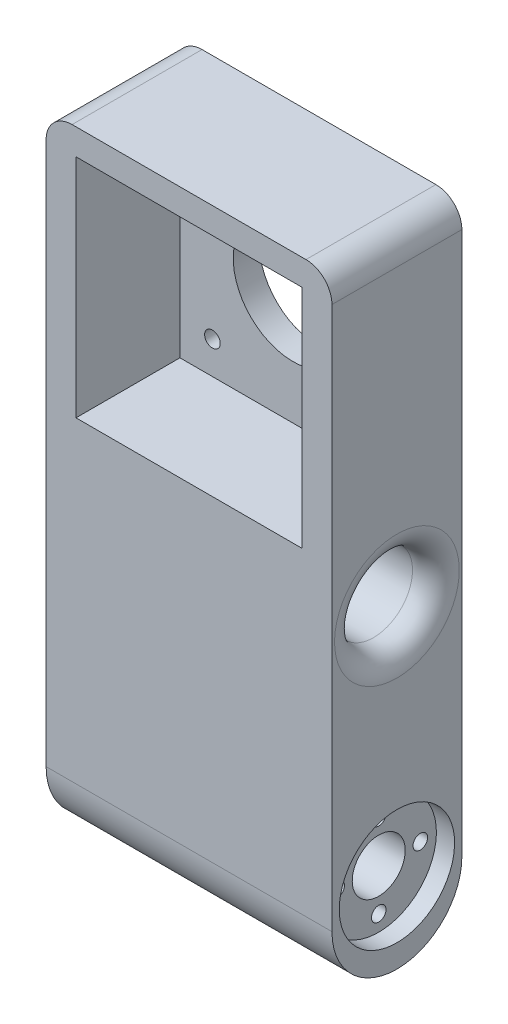
ISO-10303-21;
HEADER;
FILE_DESCRIPTION(('STEP AP214'),'2;1');
FILE_NAME('part.step','',(''),(''),'','','');
FILE_SCHEMA(('AUTOMOTIVE_DESIGN { 1 0 10303 214 1 1 1 1 }'));
ENDSEC;
DATA;
#1=APPLICATION_CONTEXT('core data for automotive mechanical design processes');
#2=APPLICATION_PROTOCOL_DEFINITION('international standard','automotive_design',2000,#1);
#3=PRODUCT_CONTEXT('',#1,'mechanical');
#4=PRODUCT('Part','Part','',(#3));
#5=PRODUCT_RELATED_PRODUCT_CATEGORY('part','',(#4));
#6=PRODUCT_DEFINITION_FORMATION('','',#4);
#7=PRODUCT_DEFINITION_CONTEXT('part definition',#1,'design');
#8=PRODUCT_DEFINITION('design','',#6,#7);
#9=PRODUCT_DEFINITION_SHAPE('','',#8);
#10=(LENGTH_UNIT() NAMED_UNIT(*) SI_UNIT(.MILLI.,.METRE.));
#11=(NAMED_UNIT(*) PLANE_ANGLE_UNIT() SI_UNIT($,.RADIAN.));
#12=(NAMED_UNIT(*) SI_UNIT($,.STERADIAN.) SOLID_ANGLE_UNIT());
#13=UNCERTAINTY_MEASURE_WITH_UNIT(LENGTH_MEASURE(1.E-05),#10,'distance_accuracy_value','');
#14=(GEOMETRIC_REPRESENTATION_CONTEXT(3) GLOBAL_UNCERTAINTY_ASSIGNED_CONTEXT((#13)) GLOBAL_UNIT_ASSIGNED_CONTEXT((#10,
#11,#12)) REPRESENTATION_CONTEXT('',''));
#15=CARTESIAN_POINT('',(0.,0.,0.));
#16=DIRECTION('',(0.,0.,1.));
#17=DIRECTION('',(1.,0.,0.));
#18=AXIS2_PLACEMENT_3D('',#15,#16,#17);
#19=CARTESIAN_POINT('',(-15.5,49.75,25.));
#20=DIRECTION('',(0.,0.,-1.));
#21=DIRECTION('',(-1.,0.,0.));
#22=AXIS2_PLACEMENT_3D('',#19,#20,#21);
#23=CYLINDRICAL_SURFACE('',#22,1.5);
#24=CARTESIAN_POINT('',(-15.5,49.75,5.));
#25=DIRECTION('',(0.,0.,1.));
#26=DIRECTION('',(1.,0.,0.));
#27=AXIS2_PLACEMENT_3D('',#24,#25,#26);
#28=CIRCLE('',#27,1.5);
#29=CARTESIAN_POINT('',(-14.,49.75,5.));
#30=VERTEX_POINT('',#29);
#31=EDGE_CURVE('E164',#30,#30,#28,.T.);
#32=ORIENTED_EDGE('',*,*,#31,.T.);
#33=EDGE_LOOP('',(#32));
#34=FACE_BOUND('',#33,.T.);
#35=CARTESIAN_POINT('',(-15.5,49.75,2.));
#36=DIRECTION('',(0.,0.,-1.));
#37=DIRECTION('',(-1.,0.,0.));
#38=AXIS2_PLACEMENT_3D('',#35,#36,#37);
#39=CIRCLE('',#38,1.5);
#40=CARTESIAN_POINT('',(-17.,49.75,2.));
#41=VERTEX_POINT('',#40);
#42=EDGE_CURVE('E40',#41,#41,#39,.T.);
#43=ORIENTED_EDGE('',*,*,#42,.T.);
#44=EDGE_LOOP('',(#43));
#45=FACE_BOUND('',#44,.T.);
#46=ADVANCED_FACE('F35',(#34,#45),#23,.F.);
#47=CARTESIAN_POINT('',(15.5,49.75,25.));
#48=DIRECTION('',(0.,0.,-1.));
#49=DIRECTION('',(-1.,0.,0.));
#50=AXIS2_PLACEMENT_3D('',#47,#48,#49);
#51=CYLINDRICAL_SURFACE('',#50,1.5);
#52=CARTESIAN_POINT('',(15.5,49.75,5.));
#53=DIRECTION('',(0.,0.,1.));
#54=DIRECTION('',(1.,0.,0.));
#55=AXIS2_PLACEMENT_3D('',#52,#53,#54);
#56=CIRCLE('',#55,1.5);
#57=CARTESIAN_POINT('',(17.,49.75,5.));
#58=VERTEX_POINT('',#57);
#59=EDGE_CURVE('E161',#58,#58,#56,.T.);
#60=ORIENTED_EDGE('',*,*,#59,.T.);
#61=EDGE_LOOP('',(#60));
#62=FACE_BOUND('',#61,.T.);
#63=CARTESIAN_POINT('',(15.5,49.75,2.));
#64=DIRECTION('',(0.,0.,-1.));
#65=DIRECTION('',(-1.,0.,0.));
#66=AXIS2_PLACEMENT_3D('',#63,#64,#65);
#67=CIRCLE('',#66,1.5);
#68=CARTESIAN_POINT('',(14.,49.75,2.));
#69=VERTEX_POINT('',#68);
#70=EDGE_CURVE('E239',#69,#69,#67,.T.);
#71=ORIENTED_EDGE('',*,*,#70,.T.);
#72=EDGE_LOOP('',(#71));
#73=FACE_BOUND('',#72,.T.);
#74=ADVANCED_FACE('F328',(#62,#73),#51,.F.);
#75=CARTESIAN_POINT('',(-15.5,18.75,25.));
#76=DIRECTION('',(0.,0.,-1.));
#77=DIRECTION('',(-1.,0.,0.));
#78=AXIS2_PLACEMENT_3D('',#75,#76,#77);
#79=CYLINDRICAL_SURFACE('',#78,1.5);
#80=CARTESIAN_POINT('',(-15.5,18.75,5.));
#81=DIRECTION('',(0.,0.,1.));
#82=DIRECTION('',(1.,0.,0.));
#83=AXIS2_PLACEMENT_3D('',#80,#81,#82);
#84=CIRCLE('',#83,1.5);
#85=CARTESIAN_POINT('',(-14.,18.75,5.));
#86=VERTEX_POINT('',#85);
#87=EDGE_CURVE('E158',#86,#86,#84,.T.);
#88=ORIENTED_EDGE('',*,*,#87,.T.);
#89=EDGE_LOOP('',(#88));
#90=FACE_BOUND('',#89,.T.);
#91=CARTESIAN_POINT('',(-15.5,18.75,2.));
#92=DIRECTION('',(0.,0.,-1.));
#93=DIRECTION('',(-1.,0.,0.));
#94=AXIS2_PLACEMENT_3D('',#91,#92,#93);
#95=CIRCLE('',#94,1.5);
#96=CARTESIAN_POINT('',(-17.,18.75,2.));
#97=VERTEX_POINT('',#96);
#98=EDGE_CURVE('E236',#97,#97,#95,.T.);
#99=ORIENTED_EDGE('',*,*,#98,.T.);
#100=EDGE_LOOP('',(#99));
#101=FACE_BOUND('',#100,.T.);
#102=ADVANCED_FACE('F334',(#90,#101),#79,.F.);
#103=CARTESIAN_POINT('',(15.5,18.75,25.));
#104=DIRECTION('',(0.,0.,-1.));
#105=DIRECTION('',(-1.,0.,0.));
#106=AXIS2_PLACEMENT_3D('',#103,#104,#105);
#107=CYLINDRICAL_SURFACE('',#106,1.5);
#108=CARTESIAN_POINT('',(15.5,18.75,5.));
#109=DIRECTION('',(0.,0.,1.));
#110=DIRECTION('',(1.,0.,0.));
#111=AXIS2_PLACEMENT_3D('',#108,#109,#110);
#112=CIRCLE('',#111,1.5);
#113=CARTESIAN_POINT('',(17.,18.75,5.));
#114=VERTEX_POINT('',#113);
#115=EDGE_CURVE('E154',#114,#114,#112,.T.);
#116=ORIENTED_EDGE('',*,*,#115,.T.);
#117=EDGE_LOOP('',(#116));
#118=FACE_BOUND('',#117,.T.);
#119=CARTESIAN_POINT('',(15.5,18.75,2.));
#120=DIRECTION('',(0.,0.,-1.));
#121=DIRECTION('',(-1.,0.,0.));
#122=AXIS2_PLACEMENT_3D('',#119,#120,#121);
#123=CIRCLE('',#122,1.5);
#124=CARTESIAN_POINT('',(14.,18.75,2.));
#125=VERTEX_POINT('',#124);
#126=EDGE_CURVE('E233',#125,#125,#123,.T.);
#127=ORIENTED_EDGE('',*,*,#126,.T.);
#128=EDGE_LOOP('',(#127));
#129=FACE_BOUND('',#128,.T.);
#130=ADVANCED_FACE('F485',(#118,#129),#107,.F.);
#131=CARTESIAN_POINT('',(-27.5,-48.4999999999999,12.5));
#132=DIRECTION('',(1.,0.,0.));
#133=DIRECTION('',(0.,0.,-1.));
#134=AXIS2_PLACEMENT_3D('',#131,#132,#133);
#135=CYLINDRICAL_SURFACE('',#134,12.5);
#136=DIRECTION('',(-1.,0.,0.));
#137=VECTOR('',#136,1.);
#138=CARTESIAN_POINT('',(-27.5,-48.4999999999999,25.));
#139=LINE('',#138,#137);
#140=CARTESIAN_POINT('',(-27.5,-48.4999999999999,25.));
#141=VERTEX_POINT('',#140);
#142=CARTESIAN_POINT('',(27.5,-48.4999999999999,25.));
#143=VERTEX_POINT('',#142);
#144=EDGE_CURVE('E227',#141,#143,#139,.F.);
#145=ORIENTED_EDGE('',*,*,#144,.F.);
#146=CARTESIAN_POINT('',(-27.5,-48.4999999999999,12.5));
#147=DIRECTION('',(1.,0.,0.));
#148=DIRECTION('',(0.,1.,0.));
#149=AXIS2_PLACEMENT_3D('',#146,#147,#148);
#150=CIRCLE('',#149,12.5);
#151=CARTESIAN_POINT('',(-27.5,-48.4999999999999,0.));
#152=VERTEX_POINT('',#151);
#153=EDGE_CURVE('E45',#152,#141,#150,.F.);
#154=ORIENTED_EDGE('',*,*,#153,.F.);
#155=DIRECTION('',(1.,0.,0.));
#156=VECTOR('',#155,1.);
#157=CARTESIAN_POINT('',(0.,-48.4999999999999,0.));
#158=LINE('',#157,#156);
#159=CARTESIAN_POINT('',(27.5,-48.4999999999999,0.));
#160=VERTEX_POINT('',#159);
#161=EDGE_CURVE('E230',#160,#152,#158,.F.);
#162=ORIENTED_EDGE('',*,*,#161,.F.);
#163=CARTESIAN_POINT('',(27.5,-48.4999999999999,12.5));
#164=DIRECTION('',(-1.,0.,0.));
#165=DIRECTION('',(0.,-1.,0.));
#166=AXIS2_PLACEMENT_3D('',#163,#164,#165);
#167=CIRCLE('',#166,12.5);
#168=EDGE_CURVE('E11',#143,#160,#167,.F.);
#169=ORIENTED_EDGE('',*,*,#168,.F.);
#170=EDGE_LOOP('',(#145,#154,#162,#169));
#171=FACE_BOUND('',#170,.T.);
#172=ADVANCED_FACE('F38',(#171),#135,.T.);
#173=CARTESIAN_POINT('',(-27.5,-45.5,12.5));
#174=DIRECTION('',(1.,0.,0.));
#175=DIRECTION('',(0.,1.,0.));
#176=AXIS2_PLACEMENT_3D('',#173,#174,#175);
#177=CYLINDRICAL_SURFACE('',#176,5.1);
#178=CARTESIAN_POINT('',(-27.5,-45.5,12.5));
#179=DIRECTION('',(1.,0.,0.));
#180=DIRECTION('',(0.,1.,0.));
#181=AXIS2_PLACEMENT_3D('',#178,#179,#180);
#182=CIRCLE('',#181,5.1);
#183=CARTESIAN_POINT('',(-27.5,-40.4,12.5));
#184=VERTEX_POINT('',#183);
#185=EDGE_CURVE('E142',#184,#184,#182,.T.);
#186=ORIENTED_EDGE('',*,*,#185,.F.);
#187=EDGE_LOOP('',(#186));
#188=FACE_BOUND('',#187,.T.);
#189=CARTESIAN_POINT('',(24.,-45.5,12.5));
#190=DIRECTION('',(1.,0.,0.));
#191=DIRECTION('',(0.,1.,0.));
#192=AXIS2_PLACEMENT_3D('',#189,#190,#191);
#193=CIRCLE('',#192,5.1);
#194=CARTESIAN_POINT('',(24.,-40.4,12.5));
#195=VERTEX_POINT('',#194);
#196=EDGE_CURVE('E192',#195,#195,#193,.F.);
#197=ORIENTED_EDGE('',*,*,#196,.F.);
#198=EDGE_LOOP('',(#197));
#199=FACE_BOUND('',#198,.T.);
#200=ADVANCED_FACE('F342',(#188,#199),#177,.F.);
#201=CARTESIAN_POINT('',(0.,34.25,25.));
#202=DIRECTION('',(0.,0.,-1.));
#203=DIRECTION('',(-1.,0.,0.));
#204=AXIS2_PLACEMENT_3D('',#201,#202,#203);
#205=CYLINDRICAL_SURFACE('',#204,11.5);
#206=CARTESIAN_POINT('',(0.,34.25,0.));
#207=DIRECTION('',(0.,0.,1.));
#208=DIRECTION('',(1.,0.,0.));
#209=AXIS2_PLACEMENT_3D('',#206,#207,#208);
#210=CIRCLE('',#209,11.5);
#211=CARTESIAN_POINT('',(11.5,34.25,0.));
#212=VERTEX_POINT('',#211);
#213=EDGE_CURVE('E170',#212,#212,#210,.T.);
#214=ORIENTED_EDGE('',*,*,#213,.F.);
#215=EDGE_LOOP('',(#214));
#216=FACE_BOUND('',#215,.T.);
#217=CARTESIAN_POINT('',(0.,34.25,5.));
#218=DIRECTION('',(0.,0.,1.));
#219=DIRECTION('',(1.,0.,0.));
#220=AXIS2_PLACEMENT_3D('',#217,#218,#219);
#221=CIRCLE('',#220,11.5);
#222=CARTESIAN_POINT('',(11.5,34.25,5.));
#223=VERTEX_POINT('',#222);
#224=EDGE_CURVE('E167',#223,#223,#221,.T.);
#225=ORIENTED_EDGE('',*,*,#224,.T.);
#226=EDGE_LOOP('',(#225));
#227=FACE_BOUND('',#226,.T.);
#228=ADVANCED_FACE('F339',(#216,#227),#205,.F.);
#229=CARTESIAN_POINT('',(0.,0.,25.));
#230=DIRECTION('',(0.,0.,1.));
#231=DIRECTION('',(1.,0.,0.));
#232=AXIS2_PLACEMENT_3D('',#229,#230,#231);
#233=PLANE('',#232);
#234=DIRECTION('',(0.,1.,0.));
#235=VECTOR('',#234,1.);
#236=CARTESIAN_POINT('',(21.75,56.,25.));
#237=LINE('',#236,#235);
#238=CARTESIAN_POINT('',(21.75,12.5,25.));
#239=VERTEX_POINT('',#238);
#240=CARTESIAN_POINT('',(21.75,56.,25.));
#241=VERTEX_POINT('',#240);
#242=EDGE_CURVE('E119',#239,#241,#237,.T.);
#243=ORIENTED_EDGE('',*,*,#242,.F.);
#244=DIRECTION('',(1.,0.,0.));
#245=VECTOR('',#244,1.);
#246=CARTESIAN_POINT('',(-21.75,12.5,25.));
#247=LINE('',#246,#245);
#248=CARTESIAN_POINT('',(-21.75,12.5,25.));
#249=VERTEX_POINT('',#248);
#250=EDGE_CURVE('E136',#249,#239,#247,.T.);
#251=ORIENTED_EDGE('',*,*,#250,.F.);
#252=DIRECTION('',(0.,-1.,0.));
#253=VECTOR('',#252,1.);
#254=CARTESIAN_POINT('',(-21.75,56.,25.));
#255=LINE('',#254,#253);
#256=CARTESIAN_POINT('',(-21.75,56.,25.));
#257=VERTEX_POINT('',#256);
#258=EDGE_CURVE('E139',#257,#249,#255,.T.);
#259=ORIENTED_EDGE('',*,*,#258,.F.);
#260=DIRECTION('',(-1.,0.,0.));
#261=VECTOR('',#260,1.);
#262=CARTESIAN_POINT('',(-21.75,56.,25.));
#263=LINE('',#262,#261);
#264=EDGE_CURVE('E148',#241,#257,#263,.T.);
#265=ORIENTED_EDGE('',*,*,#264,.F.);
#266=EDGE_LOOP('',(#243,#251,#259,#265));
#267=FACE_BOUND('',#266,.T.);
#268=DIRECTION('',(0.,-1.,0.));
#269=VECTOR('',#268,1.);
#270=CARTESIAN_POINT('',(-27.5,61.,25.));
#271=LINE('',#270,#269);
#272=CARTESIAN_POINT('',(-27.5,56.,25.));
#273=VERTEX_POINT('',#272);
#274=EDGE_CURVE('E180',#273,#141,#271,.T.);
#275=ORIENTED_EDGE('',*,*,#274,.T.);
#276=ORIENTED_EDGE('',*,*,#144,.T.);
#277=DIRECTION('',(0.,1.,0.));
#278=VECTOR('',#277,1.);
#279=CARTESIAN_POINT('',(27.5,61.,25.));
#280=LINE('',#279,#278);
#281=CARTESIAN_POINT('',(27.5,56.,25.));
#282=VERTEX_POINT('',#281);
#283=EDGE_CURVE('E174',#143,#282,#280,.T.);
#284=ORIENTED_EDGE('',*,*,#283,.T.);
#285=CARTESIAN_POINT('',(22.5,56.,25.));
#286=DIRECTION('',(0.,0.,1.));
#287=DIRECTION('',(1.,0.,0.));
#288=AXIS2_PLACEMENT_3D('',#285,#286,#287);
#289=CIRCLE('',#288,5.);
#290=CARTESIAN_POINT('',(22.5,61.,25.));
#291=VERTEX_POINT('',#290);
#292=EDGE_CURVE('E210',#282,#291,#289,.T.);
#293=ORIENTED_EDGE('',*,*,#292,.T.);
#294=DIRECTION('',(-1.,0.,0.));
#295=VECTOR('',#294,1.);
#296=CARTESIAN_POINT('',(-27.5,61.,25.));
#297=LINE('',#296,#295);
#298=CARTESIAN_POINT('',(-22.5,61.,25.));
#299=VERTEX_POINT('',#298);
#300=EDGE_CURVE('E176',#291,#299,#297,.T.);
#301=ORIENTED_EDGE('',*,*,#300,.T.);
#302=CARTESIAN_POINT('',(-22.5,56.,25.));
#303=DIRECTION('',(0.,0.,1.));
#304=DIRECTION('',(1.,0.,0.));
#305=AXIS2_PLACEMENT_3D('',#302,#303,#304);
#306=CIRCLE('',#305,5.);
#307=EDGE_CURVE('E208',#299,#273,#306,.T.);
#308=ORIENTED_EDGE('',*,*,#307,.T.);
#309=EDGE_LOOP('',(#275,#276,#284,#293,#301,#308));
#310=FACE_BOUND('',#309,.T.);
#311=ADVANCED_FACE('F296',(#267,#310),#233,.T.);
#312=CARTESIAN_POINT('',(0.,0.,0.));
#313=DIRECTION('',(0.,0.,1.));
#314=DIRECTION('',(1.,0.,0.));
#315=AXIS2_PLACEMENT_3D('',#312,#313,#314);
#316=PLANE('',#315);
#317=CARTESIAN_POINT('',(15.4999999999993,18.7500000000002,0.));
#318=DIRECTION('',(0.,0.,-1.));
#319=DIRECTION('',(-1.,0.,0.));
#320=AXIS2_PLACEMENT_3D('',#317,#318,#319);
#321=CIRCLE('',#320,3.5);
#322=CARTESIAN_POINT('',(11.9999999999993,18.7500000000002,0.));
#323=VERTEX_POINT('',#322);
#324=EDGE_CURVE('E353',#323,#323,#321,.T.);
#325=ORIENTED_EDGE('',*,*,#324,.F.);
#326=EDGE_LOOP('',(#325));
#327=FACE_BOUND('',#326,.T.);
#328=CARTESIAN_POINT('',(-15.5000000000008,18.7500000000008,0.));
#329=DIRECTION('',(0.,0.,-1.));
#330=DIRECTION('',(-1.,0.,0.));
#331=AXIS2_PLACEMENT_3D('',#328,#329,#330);
#332=CIRCLE('',#331,3.5);
#333=CARTESIAN_POINT('',(-19.0000000000008,18.7500000000008,0.));
#334=VERTEX_POINT('',#333);
#335=EDGE_CURVE('E357',#334,#334,#332,.T.);
#336=ORIENTED_EDGE('',*,*,#335,.F.);
#337=EDGE_LOOP('',(#336));
#338=FACE_BOUND('',#337,.T.);
#339=CARTESIAN_POINT('',(-15.5000000000001,49.7500000000009,0.));
#340=DIRECTION('',(0.,0.,-1.));
#341=DIRECTION('',(-1.,0.,0.));
#342=AXIS2_PLACEMENT_3D('',#339,#340,#341);
#343=CIRCLE('',#342,3.5);
#344=CARTESIAN_POINT('',(-19.0000000000001,49.7500000000009,0.));
#345=VERTEX_POINT('',#344);
#346=EDGE_CURVE('E361',#345,#345,#343,.T.);
#347=ORIENTED_EDGE('',*,*,#346,.F.);
#348=EDGE_LOOP('',(#347));
#349=FACE_BOUND('',#348,.T.);
#350=CARTESIAN_POINT('',(15.5,49.75,0.));
#351=DIRECTION('',(0.,0.,-1.));
#352=DIRECTION('',(-1.,0.,0.));
#353=AXIS2_PLACEMENT_3D('',#350,#351,#352);
#354=CIRCLE('',#353,3.5);
#355=CARTESIAN_POINT('',(12.,49.75,0.));
#356=VERTEX_POINT('',#355);
#357=EDGE_CURVE('E365',#356,#356,#354,.T.);
#358=ORIENTED_EDGE('',*,*,#357,.F.);
#359=EDGE_LOOP('',(#358));
#360=FACE_BOUND('',#359,.T.);
#361=CARTESIAN_POINT('',(0.,-23.,0.));
#362=DIRECTION('',(0.,0.,-1.));
#363=DIRECTION('',(-1.,0.,0.));
#364=AXIS2_PLACEMENT_3D('',#361,#362,#363);
#365=CIRCLE('',#364,4.1);
#366=CARTESIAN_POINT('',(-4.1,-23.,0.));
#367=VERTEX_POINT('',#366);
#368=EDGE_CURVE('E244',#367,#367,#365,.T.);
#369=ORIENTED_EDGE('',*,*,#368,.F.);
#370=EDGE_LOOP('',(#369));
#371=FACE_BOUND('',#370,.T.);
#372=DIRECTION('',(0.,1.,0.));
#373=VECTOR('',#372,1.);
#374=CARTESIAN_POINT('',(27.5,61.,0.));
#375=LINE('',#374,#373);
#376=CARTESIAN_POINT('',(27.5,56.,0.));
#377=VERTEX_POINT('',#376);
#378=EDGE_CURVE('E173',#160,#377,#375,.T.);
#379=ORIENTED_EDGE('',*,*,#378,.F.);
#380=ORIENTED_EDGE('',*,*,#161,.T.);
#381=DIRECTION('',(0.,-1.,0.));
#382=VECTOR('',#381,1.);
#383=CARTESIAN_POINT('',(-27.5,61.,0.));
#384=LINE('',#383,#382);
#385=CARTESIAN_POINT('',(-27.5,56.,0.));
#386=VERTEX_POINT('',#385);
#387=EDGE_CURVE('E177',#386,#152,#384,.T.);
#388=ORIENTED_EDGE('',*,*,#387,.F.);
#389=CARTESIAN_POINT('',(-22.5,56.,0.));
#390=DIRECTION('',(0.,0.,1.));
#391=DIRECTION('',(1.,0.,0.));
#392=AXIS2_PLACEMENT_3D('',#389,#390,#391);
#393=CIRCLE('',#392,5.);
#394=CARTESIAN_POINT('',(-22.5,61.,0.));
#395=VERTEX_POINT('',#394);
#396=EDGE_CURVE('E200',#386,#395,#393,.F.);
#397=ORIENTED_EDGE('',*,*,#396,.T.);
#398=DIRECTION('',(-1.,0.,0.));
#399=VECTOR('',#398,1.);
#400=CARTESIAN_POINT('',(-27.5,61.,0.));
#401=LINE('',#400,#399);
#402=CARTESIAN_POINT('',(22.5,61.,0.));
#403=VERTEX_POINT('',#402);
#404=EDGE_CURVE('E185',#403,#395,#401,.T.);
#405=ORIENTED_EDGE('',*,*,#404,.F.);
#406=CARTESIAN_POINT('',(22.5,56.,0.));
#407=DIRECTION('',(0.,0.,1.));
#408=DIRECTION('',(1.,0.,0.));
#409=AXIS2_PLACEMENT_3D('',#406,#407,#408);
#410=CIRCLE('',#409,5.);
#411=EDGE_CURVE('E202',#403,#377,#410,.F.);
#412=ORIENTED_EDGE('',*,*,#411,.T.);
#413=EDGE_LOOP('',(#379,#380,#388,#397,#405,#412));
#414=FACE_BOUND('',#413,.T.);
#415=ORIENTED_EDGE('',*,*,#213,.T.);
#416=EDGE_LOOP('',(#415));
#417=FACE_BOUND('',#416,.T.);
#418=ADVANCED_FACE('F290',(#327,#338,#349,#360,#371,#414,#417),#316,.F.);
#419=CARTESIAN_POINT('',(27.5,61.,25.));
#420=DIRECTION('',(-1.,0.,0.));
#421=DIRECTION('',(0.,-1.,0.));
#422=AXIS2_PLACEMENT_3D('',#419,#420,#421);
#423=PLANE('',#422);
#424=CARTESIAN_POINT('',(27.5,-0.499999999999977,12.5));
#425=DIRECTION('',(-1.,0.,0.));
#426=DIRECTION('',(0.,-1.,0.));
#427=AXIS2_PLACEMENT_3D('',#424,#425,#426);
#428=CIRCLE('',#427,12.);
#429=CARTESIAN_POINT('',(27.5,-12.5,12.5));
#430=VERTEX_POINT('',#429);
#431=EDGE_CURVE('E221',#430,#430,#428,.T.);
#432=ORIENTED_EDGE('',*,*,#431,.T.);
#433=EDGE_LOOP('',(#432));
#434=FACE_BOUND('',#433,.T.);
#435=CARTESIAN_POINT('',(27.5,-45.5,12.5));
#436=DIRECTION('',(1.,0.,0.));
#437=DIRECTION('',(0.,1.,0.));
#438=AXIS2_PLACEMENT_3D('',#435,#436,#437);
#439=CIRCLE('',#438,11.1);
#440=CARTESIAN_POINT('',(27.5,-34.4,12.5));
#441=VERTEX_POINT('',#440);
#442=EDGE_CURVE('E260',#441,#441,#439,.T.);
#443=ORIENTED_EDGE('',*,*,#442,.F.);
#444=EDGE_LOOP('',(#443));
#445=FACE_BOUND('',#444,.T.);
#446=ORIENTED_EDGE('',*,*,#283,.F.);
#447=ORIENTED_EDGE('',*,*,#168,.T.);
#448=ORIENTED_EDGE('',*,*,#378,.T.);
#449=DIRECTION('',(0.,0.,-1.));
#450=VECTOR('',#449,1.);
#451=CARTESIAN_POINT('',(27.5,56.,25.));
#452=LINE('',#451,#450);
#453=EDGE_CURVE('E205',#377,#282,#452,.F.);
#454=ORIENTED_EDGE('',*,*,#453,.T.);
#455=EDGE_LOOP('',(#446,#447,#448,#454));
#456=FACE_BOUND('',#455,.T.);
#457=ADVANCED_FACE('F287',(#434,#445,#456),#423,.F.);
#458=CARTESIAN_POINT('',(-27.5,61.,25.));
#459=DIRECTION('',(0.,-1.,0.));
#460=DIRECTION('',(0.,0.,-1.));
#461=AXIS2_PLACEMENT_3D('',#458,#459,#460);
#462=PLANE('',#461);
#463=ORIENTED_EDGE('',*,*,#300,.F.);
#464=DIRECTION('',(0.,0.,-1.));
#465=VECTOR('',#464,1.);
#466=CARTESIAN_POINT('',(22.5,61.,25.));
#467=LINE('',#466,#465);
#468=EDGE_CURVE('E197',#291,#403,#467,.T.);
#469=ORIENTED_EDGE('',*,*,#468,.T.);
#470=ORIENTED_EDGE('',*,*,#404,.T.);
#471=DIRECTION('',(0.,0.,-1.));
#472=VECTOR('',#471,1.);
#473=CARTESIAN_POINT('',(-22.5,61.,25.));
#474=LINE('',#473,#472);
#475=EDGE_CURVE('E183',#395,#299,#474,.F.);
#476=ORIENTED_EDGE('',*,*,#475,.T.);
#477=EDGE_LOOP('',(#463,#469,#470,#476));
#478=FACE_BOUND('',#477,.T.);
#479=ADVANCED_FACE('F289',(#478),#462,.F.);
#480=CARTESIAN_POINT('',(-27.5,61.,25.));
#481=DIRECTION('',(1.,0.,0.));
#482=DIRECTION('',(0.,1.,0.));
#483=AXIS2_PLACEMENT_3D('',#480,#481,#482);
#484=PLANE('',#483);
#485=CARTESIAN_POINT('',(-27.5,-0.499999999999983,12.5));
#486=DIRECTION('',(1.,0.,0.));
#487=DIRECTION('',(0.,1.,0.));
#488=AXIS2_PLACEMENT_3D('',#485,#486,#487);
#489=CIRCLE('',#488,12.);
#490=CARTESIAN_POINT('',(-27.5,11.5,12.5));
#491=VERTEX_POINT('',#490);
#492=EDGE_CURVE('E224',#491,#491,#489,.T.);
#493=ORIENTED_EDGE('',*,*,#492,.T.);
#494=EDGE_LOOP('',(#493));
#495=FACE_BOUND('',#494,.T.);
#496=ORIENTED_EDGE('',*,*,#185,.T.);
#497=EDGE_LOOP('',(#496));
#498=FACE_BOUND('',#497,.T.);
#499=ORIENTED_EDGE('',*,*,#387,.T.);
#500=ORIENTED_EDGE('',*,*,#153,.T.);
#501=ORIENTED_EDGE('',*,*,#274,.F.);
#502=DIRECTION('',(0.,0.,-1.));
#503=VECTOR('',#502,1.);
#504=CARTESIAN_POINT('',(-27.5,56.,25.));
#505=LINE('',#504,#503);
#506=EDGE_CURVE('E212',#273,#386,#505,.T.);
#507=ORIENTED_EDGE('',*,*,#506,.T.);
#508=EDGE_LOOP('',(#499,#500,#501,#507));
#509=FACE_BOUND('',#508,.T.);
#510=ADVANCED_FACE('F314',(#495,#498,#509),#484,.F.);
#511=CARTESIAN_POINT('',(21.75,56.,5.));
#512=DIRECTION('',(1.,0.,0.));
#513=DIRECTION('',(0.,1.,0.));
#514=AXIS2_PLACEMENT_3D('',#511,#512,#513);
#515=PLANE('',#514);
#516=ORIENTED_EDGE('',*,*,#242,.T.);
#517=DIRECTION('',(0.,0.,1.));
#518=VECTOR('',#517,1.);
#519=CARTESIAN_POINT('',(21.75,56.,5.));
#520=LINE('',#519,#518);
#521=CARTESIAN_POINT('',(21.75,56.,5.));
#522=VERTEX_POINT('',#521);
#523=EDGE_CURVE('E112',#522,#241,#520,.T.);
#524=ORIENTED_EDGE('',*,*,#523,.F.);
#525=DIRECTION('',(0.,1.,0.));
#526=VECTOR('',#525,1.);
#527=CARTESIAN_POINT('',(21.75,56.,5.));
#528=LINE('',#527,#526);
#529=CARTESIAN_POINT('',(21.75,12.5,5.));
#530=VERTEX_POINT('',#529);
#531=EDGE_CURVE('E116',#530,#522,#528,.T.);
#532=ORIENTED_EDGE('',*,*,#531,.F.);
#533=DIRECTION('',(0.,0.,1.));
#534=VECTOR('',#533,1.);
#535=CARTESIAN_POINT('',(21.75,12.5,5.));
#536=LINE('',#535,#534);
#537=EDGE_CURVE('E152',#530,#239,#536,.T.);
#538=ORIENTED_EDGE('',*,*,#537,.T.);
#539=EDGE_LOOP('',(#516,#524,#532,#538));
#540=FACE_BOUND('',#539,.T.);
#541=ADVANCED_FACE('F114',(#540),#515,.F.);
#542=CARTESIAN_POINT('',(-21.75,12.5,5.));
#543=DIRECTION('',(0.,-1.,0.));
#544=DIRECTION('',(0.,0.,-1.));
#545=AXIS2_PLACEMENT_3D('',#542,#543,#544);
#546=PLANE('',#545);
#547=ORIENTED_EDGE('',*,*,#250,.T.);
#548=ORIENTED_EDGE('',*,*,#537,.F.);
#549=DIRECTION('',(1.,0.,0.));
#550=VECTOR('',#549,1.);
#551=CARTESIAN_POINT('',(-21.75,12.5,5.));
#552=LINE('',#551,#550);
#553=CARTESIAN_POINT('',(-21.75,12.5,5.));
#554=VERTEX_POINT('',#553);
#555=EDGE_CURVE('E124',#554,#530,#552,.T.);
#556=ORIENTED_EDGE('',*,*,#555,.F.);
#557=DIRECTION('',(0.,0.,1.));
#558=VECTOR('',#557,1.);
#559=CARTESIAN_POINT('',(-21.75,12.5,5.));
#560=LINE('',#559,#558);
#561=EDGE_CURVE('E155',#554,#249,#560,.T.);
#562=ORIENTED_EDGE('',*,*,#561,.T.);
#563=EDGE_LOOP('',(#547,#548,#556,#562));
#564=FACE_BOUND('',#563,.T.);
#565=ADVANCED_FACE('F322',(#564),#546,.F.);
#566=CARTESIAN_POINT('',(-21.75,56.,5.));
#567=DIRECTION('',(-1.,0.,0.));
#568=DIRECTION('',(0.,-1.,0.));
#569=AXIS2_PLACEMENT_3D('',#566,#567,#568);
#570=PLANE('',#569);
#571=ORIENTED_EDGE('',*,*,#258,.T.);
#572=ORIENTED_EDGE('',*,*,#561,.F.);
#573=DIRECTION('',(0.,-1.,0.));
#574=VECTOR('',#573,1.);
#575=CARTESIAN_POINT('',(-21.75,56.,5.));
#576=LINE('',#575,#574);
#577=CARTESIAN_POINT('',(-21.75,56.,5.));
#578=VERTEX_POINT('',#577);
#579=EDGE_CURVE('E132',#578,#554,#576,.T.);
#580=ORIENTED_EDGE('',*,*,#579,.F.);
#581=DIRECTION('',(0.,0.,1.));
#582=VECTOR('',#581,1.);
#583=CARTESIAN_POINT('',(-21.75,56.,5.));
#584=LINE('',#583,#582);
#585=EDGE_CURVE('E123',#578,#257,#584,.T.);
#586=ORIENTED_EDGE('',*,*,#585,.T.);
#587=EDGE_LOOP('',(#571,#572,#580,#586));
#588=FACE_BOUND('',#587,.T.);
#589=ADVANCED_FACE('F478',(#588),#570,.F.);
#590=CARTESIAN_POINT('',(-21.75,56.,5.));
#591=DIRECTION('',(0.,1.,0.));
#592=DIRECTION('',(0.,0.,1.));
#593=AXIS2_PLACEMENT_3D('',#590,#591,#592);
#594=PLANE('',#593);
#595=ORIENTED_EDGE('',*,*,#264,.T.);
#596=ORIENTED_EDGE('',*,*,#585,.F.);
#597=DIRECTION('',(-1.,0.,0.));
#598=VECTOR('',#597,1.);
#599=CARTESIAN_POINT('',(-21.75,56.,5.));
#600=LINE('',#599,#598);
#601=EDGE_CURVE('E127',#522,#578,#600,.T.);
#602=ORIENTED_EDGE('',*,*,#601,.F.);
#603=ORIENTED_EDGE('',*,*,#523,.T.);
#604=EDGE_LOOP('',(#595,#596,#602,#603));
#605=FACE_BOUND('',#604,.T.);
#606=ADVANCED_FACE('F128',(#605),#594,.F.);
#607=CARTESIAN_POINT('',(0.,0.,5.));
#608=DIRECTION('',(0.,0.,1.));
#609=DIRECTION('',(1.,0.,0.));
#610=AXIS2_PLACEMENT_3D('',#607,#608,#609);
#611=PLANE('',#610);
#612=ORIENTED_EDGE('',*,*,#224,.F.);
#613=EDGE_LOOP('',(#612));
#614=FACE_BOUND('',#613,.T.);
#615=ORIENTED_EDGE('',*,*,#31,.F.);
#616=EDGE_LOOP('',(#615));
#617=FACE_BOUND('',#616,.T.);
#618=ORIENTED_EDGE('',*,*,#59,.F.);
#619=EDGE_LOOP('',(#618));
#620=FACE_BOUND('',#619,.T.);
#621=ORIENTED_EDGE('',*,*,#87,.F.);
#622=EDGE_LOOP('',(#621));
#623=FACE_BOUND('',#622,.T.);
#624=ORIENTED_EDGE('',*,*,#115,.F.);
#625=EDGE_LOOP('',(#624));
#626=FACE_BOUND('',#625,.T.);
#627=ORIENTED_EDGE('',*,*,#531,.T.);
#628=ORIENTED_EDGE('',*,*,#601,.T.);
#629=ORIENTED_EDGE('',*,*,#579,.T.);
#630=ORIENTED_EDGE('',*,*,#555,.T.);
#631=EDGE_LOOP('',(#627,#628,#629,#630));
#632=FACE_BOUND('',#631,.T.);
#633=ADVANCED_FACE('F134',(#614,#617,#620,#623,#626,#632),#611,.T.);
#634=CARTESIAN_POINT('',(-27.5,-0.499999999999984,12.5));
#635=DIRECTION('',(1.,0.,0.));
#636=DIRECTION('',(0.,1.,0.));
#637=AXIS2_PLACEMENT_3D('',#634,#635,#636);
#638=CYLINDRICAL_SURFACE('',#637,7.5);
#639=CARTESIAN_POINT('',(23.,-0.499999999999976,12.5));
#640=DIRECTION('',(-1.,0.,0.));
#641=DIRECTION('',(0.,-1.,0.));
#642=AXIS2_PLACEMENT_3D('',#639,#640,#641);
#643=CIRCLE('',#642,7.5);
#644=CARTESIAN_POINT('',(23.,7.00000000000002,12.5));
#645=VERTEX_POINT('',#644);
#646=EDGE_CURVE('E218',#645,#645,#643,.F.);
#647=CARTESIAN_POINT('',(-23.,-0.499999999999983,12.5));
#648=DIRECTION('',(1.,0.,0.));
#649=DIRECTION('',(0.,1.,0.));
#650=AXIS2_PLACEMENT_3D('',#647,#648,#649);
#651=CIRCLE('',#650,7.5);
#652=CARTESIAN_POINT('',(-23.,7.00000000000002,12.5));
#653=VERTEX_POINT('',#652);
#654=EDGE_CURVE('E215',#653,#653,#651,.F.);
#655=CARTESIAN_POINT('',(23.,7.00000000000002,12.5));
#656=CARTESIAN_POINT('',(22.5208333333333,7.00000000000002,12.5));
#657=CARTESIAN_POINT('',(22.0416666666667,7.00000000000002,12.5));
#658=CARTESIAN_POINT('',(21.0833333333333,7.00000000000002,12.5));
#659=CARTESIAN_POINT('',(20.6041666666667,7.00000000000002,12.5));
#660=CARTESIAN_POINT('',(19.6458333333333,7.00000000000002,12.5));
#661=CARTESIAN_POINT('',(19.1666666666667,7.00000000000002,12.5));
#662=CARTESIAN_POINT('',(18.2083333333333,7.00000000000002,12.5));
#663=CARTESIAN_POINT('',(17.7291666666667,7.00000000000002,12.5));
#664=CARTESIAN_POINT('',(16.7708333333333,7.00000000000002,12.5));
#665=CARTESIAN_POINT('',(16.2916666666667,7.00000000000002,12.5));
#666=CARTESIAN_POINT('',(15.3333333333333,7.00000000000002,12.5));
#667=CARTESIAN_POINT('',(14.8541666666667,7.00000000000002,12.5));
#668=CARTESIAN_POINT('',(13.8958333333333,7.00000000000002,12.5));
#669=CARTESIAN_POINT('',(13.4166666666667,7.00000000000002,12.5));
#670=CARTESIAN_POINT('',(12.4583333333333,7.00000000000002,12.5));
#671=CARTESIAN_POINT('',(11.9791666666667,7.00000000000002,12.5));
#672=CARTESIAN_POINT('',(11.0208333333333,7.00000000000002,12.5));
#673=CARTESIAN_POINT('',(10.5416666666667,7.00000000000002,12.5));
#674=CARTESIAN_POINT('',(9.58333333333333,7.00000000000002,12.5));
#675=CARTESIAN_POINT('',(9.10416666666666,7.00000000000002,12.5));
#676=CARTESIAN_POINT('',(8.14583333333333,7.00000000000002,12.5));
#677=CARTESIAN_POINT('',(7.66666666666666,7.00000000000002,12.5));
#678=CARTESIAN_POINT('',(6.70833333333332,7.00000000000002,12.5));
#679=CARTESIAN_POINT('',(6.22916666666666,7.00000000000002,12.5));
#680=CARTESIAN_POINT('',(5.27083333333333,7.00000000000002,12.5));
#681=CARTESIAN_POINT('',(4.79166666666666,7.00000000000002,12.5));
#682=CARTESIAN_POINT('',(3.83333333333333,7.00000000000002,12.5));
#683=CARTESIAN_POINT('',(3.35416666666666,7.00000000000002,12.5));
#684=CARTESIAN_POINT('',(2.39583333333333,7.00000000000002,12.5));
#685=CARTESIAN_POINT('',(1.91666666666666,7.00000000000002,12.5));
#686=CARTESIAN_POINT('',(0.958333333333327,7.00000000000002,12.5));
#687=CARTESIAN_POINT('',(0.47916666666666,7.00000000000002,12.5));
#688=CARTESIAN_POINT('',(-0.479166666666674,7.00000000000002,12.5));
#689=CARTESIAN_POINT('',(-0.958333333333341,7.00000000000002,12.5));
#690=CARTESIAN_POINT('',(-1.91666666666667,7.00000000000002,12.5));
#691=CARTESIAN_POINT('',(-2.39583333333334,7.00000000000002,12.5));
#692=CARTESIAN_POINT('',(-3.35416666666667,7.00000000000002,12.5));
#693=CARTESIAN_POINT('',(-3.83333333333334,7.00000000000002,12.5));
#694=CARTESIAN_POINT('',(-4.79166666666667,7.00000000000002,12.5));
#695=CARTESIAN_POINT('',(-5.27083333333334,7.00000000000002,12.5));
#696=CARTESIAN_POINT('',(-6.22916666666667,7.00000000000002,12.5));
#697=CARTESIAN_POINT('',(-6.70833333333334,7.00000000000002,12.5));
#698=CARTESIAN_POINT('',(-7.66666666666667,7.00000000000002,12.5));
#699=CARTESIAN_POINT('',(-8.14583333333334,7.00000000000002,12.5));
#700=CARTESIAN_POINT('',(-9.10416666666667,7.00000000000002,12.5));
#701=CARTESIAN_POINT('',(-9.58333333333334,7.00000000000002,12.5));
#702=CARTESIAN_POINT('',(-10.5416666666667,7.00000000000002,12.5));
#703=CARTESIAN_POINT('',(-11.0208333333333,7.00000000000002,12.5));
#704=CARTESIAN_POINT('',(-11.9791666666667,7.00000000000002,12.5));
#705=CARTESIAN_POINT('',(-12.4583333333333,7.00000000000002,12.5));
#706=CARTESIAN_POINT('',(-13.4166666666667,7.00000000000002,12.5));
#707=CARTESIAN_POINT('',(-13.8958333333333,7.00000000000002,12.5));
#708=CARTESIAN_POINT('',(-14.8541666666667,7.00000000000002,12.5));
#709=CARTESIAN_POINT('',(-15.3333333333333,7.00000000000002,12.5));
#710=CARTESIAN_POINT('',(-16.2916666666667,7.00000000000002,12.5));
#711=CARTESIAN_POINT('',(-16.7708333333333,7.00000000000002,12.5));
#712=CARTESIAN_POINT('',(-17.7291666666667,7.00000000000002,12.5));
#713=CARTESIAN_POINT('',(-18.2083333333333,7.00000000000002,12.5));
#714=CARTESIAN_POINT('',(-19.1666666666667,7.00000000000002,12.5));
#715=CARTESIAN_POINT('',(-19.6458333333333,7.00000000000002,12.5));
#716=CARTESIAN_POINT('',(-20.6041666666667,7.00000000000002,12.5));
#717=CARTESIAN_POINT('',(-21.0833333333333,7.00000000000002,12.5));
#718=CARTESIAN_POINT('',(-22.0416666666667,7.00000000000002,12.5));
#719=CARTESIAN_POINT('',(-22.5208333333333,7.00000000000002,12.5));
#720=CARTESIAN_POINT('',(-23.,7.00000000000002,12.5));
#721=B_SPLINE_CURVE_WITH_KNOTS('',3,(#655,#656,#657,#658,#659,#660,#661,#662,#663,#664,#665,
#666,#667,#668,#669,#670,#671,#672,#673,#674,#675,#676,#677,#678,#679,#680,#681,#682,#683,#684,
#685,#686,#687,#688,#689,#690,#691,#692,#693,#694,#695,#696,#697,#698,#699,#700,#701,#702,#703,
#704,#705,#706,#707,#708,#709,#710,#711,#712,#713,#714,#715,#716,#717,#718,#719,#720),
.UNSPECIFIED.,.F.,.F.,(4,2,2,2,2,2,2,2,2,2,2,2,2,2,2,2,2,2,2,2,2,2,2,2,2,2,2,2,2,2,2,2,4),(0.,
1.4375,2.875,4.3125,5.75,7.1875,8.625,10.0625,11.5,12.9375,14.375,15.8125,17.25,18.6875,20.125,
21.5625,23.,24.4375,25.875,27.3125,28.75,30.1875,31.625,33.0625,34.5,35.9375,37.375,38.8125,
40.25,41.6875,43.125,44.5625,46.),.UNSPECIFIED.);
#722=EDGE_CURVE('BSEAM462',#645,#653,#721,.T.);
#723=ORIENTED_EDGE('',*,*,#646,.T.);
#724=ORIENTED_EDGE('',*,*,#654,.T.);
#725=ORIENTED_EDGE('',*,*,#722,.T.);
#726=ORIENTED_EDGE('',*,*,#722,.F.);
#727=EDGE_LOOP('',(#723,#725,#724,#726));
#728=FACE_BOUND('',#727,.T.);
#729=ADVANCED_FACE('F462',(#728),#638,.F.);
#730=CARTESIAN_POINT('',(24.,-45.5,12.5));
#731=DIRECTION('',(1.,0.,0.));
#732=DIRECTION('',(0.,1.,0.));
#733=AXIS2_PLACEMENT_3D('',#730,#731,#732);
#734=PLANE('',#733);
#735=CARTESIAN_POINT('',(24.,-37.5,12.5));
#736=DIRECTION('',(1.,0.,0.));
#737=DIRECTION('',(0.,1.,0.));
#738=AXIS2_PLACEMENT_3D('',#735,#736,#737);
#739=CIRCLE('',#738,1.4);
#740=CARTESIAN_POINT('',(24.,-36.1,12.5));
#741=VERTEX_POINT('',#740);
#742=EDGE_CURVE('E261',#741,#741,#739,.T.);
#743=ORIENTED_EDGE('',*,*,#742,.F.);
#744=EDGE_LOOP('',(#743));
#745=FACE_BOUND('',#744,.T.);
#746=CARTESIAN_POINT('',(24.,-45.4999999999999,4.49999999999989));
#747=DIRECTION('',(1.,0.,0.));
#748=DIRECTION('',(0.,1.,0.));
#749=AXIS2_PLACEMENT_3D('',#746,#747,#748);
#750=CIRCLE('',#749,1.4);
#751=CARTESIAN_POINT('',(24.,-44.0999999999999,4.49999999999989));
#752=VERTEX_POINT('',#751);
#753=EDGE_CURVE('E267',#752,#752,#750,.T.);
#754=ORIENTED_EDGE('',*,*,#753,.F.);
#755=EDGE_LOOP('',(#754));
#756=FACE_BOUND('',#755,.T.);
#757=CARTESIAN_POINT('',(24.,-53.5,12.4999999999998));
#758=DIRECTION('',(1.,0.,0.));
#759=DIRECTION('',(0.,1.,0.));
#760=AXIS2_PLACEMENT_3D('',#757,#758,#759);
#761=CIRCLE('',#760,1.4);
#762=CARTESIAN_POINT('',(24.,-52.1,12.4999999999998));
#763=VERTEX_POINT('',#762);
#764=EDGE_CURVE('E273',#763,#763,#761,.T.);
#765=ORIENTED_EDGE('',*,*,#764,.F.);
#766=EDGE_LOOP('',(#765));
#767=FACE_BOUND('',#766,.T.);
#768=CARTESIAN_POINT('',(24.,-45.5,20.4999999999999));
#769=DIRECTION('',(1.,0.,0.));
#770=DIRECTION('',(0.,1.,0.));
#771=AXIS2_PLACEMENT_3D('',#768,#769,#770);
#772=CIRCLE('',#771,1.4);
#773=CARTESIAN_POINT('',(24.,-44.1,20.4999999999999));
#774=VERTEX_POINT('',#773);
#775=EDGE_CURVE('E253',#774,#774,#772,.T.);
#776=ORIENTED_EDGE('',*,*,#775,.F.);
#777=EDGE_LOOP('',(#776));
#778=FACE_BOUND('',#777,.T.);
#779=CARTESIAN_POINT('',(24.,-45.5,12.5));
#780=DIRECTION('',(1.,0.,0.));
#781=DIRECTION('',(0.,1.,0.));
#782=AXIS2_PLACEMENT_3D('',#779,#780,#781);
#783=CIRCLE('',#782,11.1);
#784=CARTESIAN_POINT('',(24.,-34.4,12.5));
#785=VERTEX_POINT('',#784);
#786=EDGE_CURVE('E195',#785,#785,#783,.T.);
#787=ORIENTED_EDGE('',*,*,#786,.T.);
#788=EDGE_LOOP('',(#787));
#789=FACE_BOUND('',#788,.T.);
#790=ORIENTED_EDGE('',*,*,#196,.T.);
#791=EDGE_LOOP('',(#790));
#792=FACE_BOUND('',#791,.T.);
#793=ADVANCED_FACE('F459',(#745,#756,#767,#778,#789,#792),#734,.T.);
#794=CARTESIAN_POINT('',(24.,-45.5,12.5));
#795=DIRECTION('',(1.,0.,0.));
#796=DIRECTION('',(0.,1.,0.));
#797=AXIS2_PLACEMENT_3D('',#794,#795,#796);
#798=CYLINDRICAL_SURFACE('',#797,11.1);
#799=ORIENTED_EDGE('',*,*,#786,.F.);
#800=EDGE_LOOP('',(#799));
#801=FACE_BOUND('',#800,.T.);
#802=ORIENTED_EDGE('',*,*,#442,.T.);
#803=EDGE_LOOP('',(#802));
#804=FACE_BOUND('',#803,.T.);
#805=ADVANCED_FACE('F285',(#801,#804),#798,.F.);
#806=CARTESIAN_POINT('',(14.,-45.5,20.4999999999999));
#807=DIRECTION('',(1.,0.,0.));
#808=DIRECTION('',(0.,1.,0.));
#809=AXIS2_PLACEMENT_3D('',#806,#807,#808);
#810=CYLINDRICAL_SURFACE('',#809,1.4);
#811=CARTESIAN_POINT('',(14.,-45.5,20.4999999999999));
#812=DIRECTION('',(1.,0.,0.));
#813=DIRECTION('',(0.,1.,0.));
#814=AXIS2_PLACEMENT_3D('',#811,#812,#813);
#815=CIRCLE('',#814,1.4);
#816=CARTESIAN_POINT('',(14.,-44.1,20.4999999999999));
#817=VERTEX_POINT('',#816);
#818=EDGE_CURVE('E276',#817,#817,#815,.T.);
#819=ORIENTED_EDGE('',*,*,#818,.F.);
#820=EDGE_LOOP('',(#819));
#821=FACE_BOUND('',#820,.T.);
#822=ORIENTED_EDGE('',*,*,#775,.T.);
#823=EDGE_LOOP('',(#822));
#824=FACE_BOUND('',#823,.T.);
#825=ADVANCED_FACE('F454',(#821,#824),#810,.F.);
#826=CARTESIAN_POINT('',(14.,-45.5,20.4999999999999));
#827=DIRECTION('',(1.,0.,0.));
#828=DIRECTION('',(0.,1.,0.));
#829=AXIS2_PLACEMENT_3D('',#826,#827,#828);
#830=PLANE('',#829);
#831=ORIENTED_EDGE('',*,*,#818,.T.);
#832=EDGE_LOOP('',(#831));
#833=FACE_BOUND('',#832,.T.);
#834=ADVANCED_FACE('F450',(#833),#830,.T.);
#835=CARTESIAN_POINT('',(14.,-53.5,12.4999999999998));
#836=DIRECTION('',(1.,0.,0.));
#837=DIRECTION('',(0.,1.,0.));
#838=AXIS2_PLACEMENT_3D('',#835,#836,#837);
#839=CYLINDRICAL_SURFACE('',#838,1.4);
#840=CARTESIAN_POINT('',(14.,-53.5,12.4999999999998));
#841=DIRECTION('',(1.,0.,0.));
#842=DIRECTION('',(0.,1.,0.));
#843=AXIS2_PLACEMENT_3D('',#840,#841,#842);
#844=CIRCLE('',#843,1.4);
#845=CARTESIAN_POINT('',(14.,-52.1,12.4999999999998));
#846=VERTEX_POINT('',#845);
#847=EDGE_CURVE('E270',#846,#846,#844,.T.);
#848=ORIENTED_EDGE('',*,*,#847,.F.);
#849=EDGE_LOOP('',(#848));
#850=FACE_BOUND('',#849,.T.);
#851=ORIENTED_EDGE('',*,*,#764,.T.);
#852=EDGE_LOOP('',(#851));
#853=FACE_BOUND('',#852,.T.);
#854=ADVANCED_FACE('F446',(#850,#853),#839,.F.);
#855=CARTESIAN_POINT('',(14.,-53.5,12.4999999999998));
#856=DIRECTION('',(1.,0.,0.));
#857=DIRECTION('',(0.,1.,0.));
#858=AXIS2_PLACEMENT_3D('',#855,#856,#857);
#859=PLANE('',#858);
#860=ORIENTED_EDGE('',*,*,#847,.T.);
#861=EDGE_LOOP('',(#860));
#862=FACE_BOUND('',#861,.T.);
#863=ADVANCED_FACE('F442',(#862),#859,.T.);
#864=CARTESIAN_POINT('',(14.,-45.4999999999999,4.49999999999989));
#865=DIRECTION('',(1.,0.,0.));
#866=DIRECTION('',(0.,1.,0.));
#867=AXIS2_PLACEMENT_3D('',#864,#865,#866);
#868=CYLINDRICAL_SURFACE('',#867,1.4);
#869=CARTESIAN_POINT('',(14.,-45.4999999999999,4.49999999999989));
#870=DIRECTION('',(1.,0.,0.));
#871=DIRECTION('',(0.,1.,0.));
#872=AXIS2_PLACEMENT_3D('',#869,#870,#871);
#873=CIRCLE('',#872,1.4);
#874=CARTESIAN_POINT('',(14.,-44.0999999999999,4.49999999999989));
#875=VERTEX_POINT('',#874);
#876=EDGE_CURVE('E264',#875,#875,#873,.T.);
#877=ORIENTED_EDGE('',*,*,#876,.F.);
#878=EDGE_LOOP('',(#877));
#879=FACE_BOUND('',#878,.T.);
#880=ORIENTED_EDGE('',*,*,#753,.T.);
#881=EDGE_LOOP('',(#880));
#882=FACE_BOUND('',#881,.T.);
#883=ADVANCED_FACE('F438',(#879,#882),#868,.F.);
#884=CARTESIAN_POINT('',(14.,-45.4999999999999,4.49999999999989));
#885=DIRECTION('',(1.,0.,0.));
#886=DIRECTION('',(0.,1.,0.));
#887=AXIS2_PLACEMENT_3D('',#884,#885,#886);
#888=PLANE('',#887);
#889=ORIENTED_EDGE('',*,*,#876,.T.);
#890=EDGE_LOOP('',(#889));
#891=FACE_BOUND('',#890,.T.);
#892=ADVANCED_FACE('F434',(#891),#888,.T.);
#893=CARTESIAN_POINT('',(14.,-37.5,12.5));
#894=DIRECTION('',(1.,0.,0.));
#895=DIRECTION('',(0.,1.,0.));
#896=AXIS2_PLACEMENT_3D('',#893,#894,#895);
#897=CYLINDRICAL_SURFACE('',#896,1.4);
#898=CARTESIAN_POINT('',(14.,-37.5,12.5));
#899=DIRECTION('',(1.,0.,0.));
#900=DIRECTION('',(0.,1.,0.));
#901=AXIS2_PLACEMENT_3D('',#898,#899,#900);
#902=CIRCLE('',#901,1.4);
#903=CARTESIAN_POINT('',(14.,-36.1,12.5));
#904=VERTEX_POINT('',#903);
#905=EDGE_CURVE('E257',#904,#904,#902,.T.);
#906=ORIENTED_EDGE('',*,*,#905,.F.);
#907=EDGE_LOOP('',(#906));
#908=FACE_BOUND('',#907,.T.);
#909=ORIENTED_EDGE('',*,*,#742,.T.);
#910=EDGE_LOOP('',(#909));
#911=FACE_BOUND('',#910,.T.);
#912=ADVANCED_FACE('F430',(#908,#911),#897,.F.);
#913=CARTESIAN_POINT('',(14.,-37.5,12.5));
#914=DIRECTION('',(1.,0.,0.));
#915=DIRECTION('',(0.,1.,0.));
#916=AXIS2_PLACEMENT_3D('',#913,#914,#915);
#917=PLANE('',#916);
#918=ORIENTED_EDGE('',*,*,#905,.T.);
#919=EDGE_LOOP('',(#918));
#920=FACE_BOUND('',#919,.T.);
#921=ADVANCED_FACE('F426',(#920),#917,.T.);
#922=CARTESIAN_POINT('',(0.,-23.,18.));
#923=DIRECTION('',(0.,0.,-1.));
#924=DIRECTION('',(-1.,0.,0.));
#925=AXIS2_PLACEMENT_3D('',#922,#923,#924);
#926=CYLINDRICAL_SURFACE('',#925,4.1);
#927=CARTESIAN_POINT('',(0.,-23.,18.));
#928=DIRECTION('',(0.,0.,-1.));
#929=DIRECTION('',(-1.,0.,0.));
#930=AXIS2_PLACEMENT_3D('',#927,#928,#929);
#931=CIRCLE('',#930,4.1);
#932=CARTESIAN_POINT('',(-4.1,-23.,18.));
#933=VERTEX_POINT('',#932);
#934=EDGE_CURVE('E248',#933,#933,#931,.T.);
#935=ORIENTED_EDGE('',*,*,#934,.F.);
#936=EDGE_LOOP('',(#935));
#937=FACE_BOUND('',#936,.T.);
#938=ORIENTED_EDGE('',*,*,#368,.T.);
#939=EDGE_LOOP('',(#938));
#940=FACE_BOUND('',#939,.T.);
#941=ADVANCED_FACE('F422',(#937,#940),#926,.F.);
#942=CARTESIAN_POINT('',(0.,-23.,18.));
#943=DIRECTION('',(0.,0.,-1.));
#944=DIRECTION('',(-1.,0.,0.));
#945=AXIS2_PLACEMENT_3D('',#942,#943,#944);
#946=PLANE('',#945);
#947=ORIENTED_EDGE('',*,*,#934,.T.);
#948=EDGE_LOOP('',(#947));
#949=FACE_BOUND('',#948,.T.);
#950=ADVANCED_FACE('F419',(#949),#946,.T.);
#951=CARTESIAN_POINT('',(22.5,56.,25.));
#952=DIRECTION('',(0.,0.,-1.));
#953=DIRECTION('',(-1.,0.,0.));
#954=AXIS2_PLACEMENT_3D('',#951,#952,#953);
#955=CYLINDRICAL_SURFACE('',#954,5.);
#956=ORIENTED_EDGE('',*,*,#292,.F.);
#957=ORIENTED_EDGE('',*,*,#453,.F.);
#958=ORIENTED_EDGE('',*,*,#411,.F.);
#959=ORIENTED_EDGE('',*,*,#468,.F.);
#960=EDGE_LOOP('',(#956,#957,#958,#959));
#961=FACE_BOUND('',#960,.T.);
#962=ADVANCED_FACE('F306',(#961),#955,.T.);
#963=CARTESIAN_POINT('',(-22.5,56.,25.));
#964=DIRECTION('',(0.,0.,-1.));
#965=DIRECTION('',(-1.,0.,0.));
#966=AXIS2_PLACEMENT_3D('',#963,#964,#965);
#967=CYLINDRICAL_SURFACE('',#966,5.);
#968=ORIENTED_EDGE('',*,*,#307,.F.);
#969=ORIENTED_EDGE('',*,*,#475,.F.);
#970=ORIENTED_EDGE('',*,*,#396,.F.);
#971=ORIENTED_EDGE('',*,*,#506,.F.);
#972=EDGE_LOOP('',(#968,#969,#970,#971));
#973=FACE_BOUND('',#972,.T.);
#974=ADVANCED_FACE('F312',(#973),#967,.T.);
#975=CARTESIAN_POINT('',(23.,-0.499999999999976,12.5));
#976=DIRECTION('',(-1.,0.,0.));
#977=DIRECTION('',(0.,-1.,0.));
#978=AXIS2_PLACEMENT_3D('',#975,#976,#977);
#979=TOROIDAL_SURFACE('',#978,12.,4.5);
#980=ORIENTED_EDGE('',*,*,#431,.F.);
#981=EDGE_LOOP('',(#980));
#982=FACE_BOUND('',#981,.T.);
#983=ORIENTED_EDGE('',*,*,#646,.F.);
#984=EDGE_LOOP('',(#983));
#985=FACE_BOUND('',#984,.T.);
#986=ADVANCED_FACE('F569',(#982,#985),#979,.T.);
#987=CARTESIAN_POINT('',(-23.,-0.499999999999983,12.5));
#988=DIRECTION('',(1.,0.,0.));
#989=DIRECTION('',(0.,1.,0.));
#990=AXIS2_PLACEMENT_3D('',#987,#988,#989);
#991=TOROIDAL_SURFACE('',#990,12.,4.5);
#992=ORIENTED_EDGE('',*,*,#654,.F.);
#993=EDGE_LOOP('',(#992));
#994=FACE_BOUND('',#993,.T.);
#995=ORIENTED_EDGE('',*,*,#492,.F.);
#996=EDGE_LOOP('',(#995));
#997=FACE_BOUND('',#996,.T.);
#998=ADVANCED_FACE('F417',(#994,#997),#991,.T.);
#999=CARTESIAN_POINT('',(15.5,49.75,2.));
#1000=DIRECTION('',(0.,0.,-1.));
#1001=DIRECTION('',(-1.,0.,0.));
#1002=AXIS2_PLACEMENT_3D('',#999,#1000,#1001);
#1003=CYLINDRICAL_SURFACE('',#1002,3.5);
#1004=CARTESIAN_POINT('',(15.5,49.75,2.));
#1005=DIRECTION('',(0.,0.,-1.));
#1006=DIRECTION('',(-1.,0.,0.));
#1007=AXIS2_PLACEMENT_3D('',#1004,#1005,#1006);
#1008=CIRCLE('',#1007,3.5);
#1009=CARTESIAN_POINT('',(12.,49.75,2.));
#1010=VERTEX_POINT('',#1009);
#1011=EDGE_CURVE('E237',#1010,#1010,#1008,.T.);
#1012=ORIENTED_EDGE('',*,*,#1011,.F.);
#1013=EDGE_LOOP('',(#1012));
#1014=FACE_BOUND('',#1013,.T.);
#1015=ORIENTED_EDGE('',*,*,#357,.T.);
#1016=EDGE_LOOP('',(#1015));
#1017=FACE_BOUND('',#1016,.T.);
#1018=ADVANCED_FACE('F395',(#1014,#1017),#1003,.F.);
#1019=CARTESIAN_POINT('',(15.5,49.75,2.));
#1020=DIRECTION('',(0.,0.,-1.));
#1021=DIRECTION('',(-1.,0.,0.));
#1022=AXIS2_PLACEMENT_3D('',#1019,#1020,#1021);
#1023=PLANE('',#1022);
#1024=ORIENTED_EDGE('',*,*,#70,.F.);
#1025=EDGE_LOOP('',(#1024));
#1026=FACE_BOUND('',#1025,.T.);
#1027=ORIENTED_EDGE('',*,*,#1011,.T.);
#1028=EDGE_LOOP('',(#1027));
#1029=FACE_BOUND('',#1028,.T.);
#1030=ADVANCED_FACE('F385',(#1026,#1029),#1023,.T.);
#1031=CARTESIAN_POINT('',(-15.5000000000001,49.7500000000009,2.));
#1032=DIRECTION('',(0.,0.,-1.));
#1033=DIRECTION('',(-1.,0.,0.));
#1034=AXIS2_PLACEMENT_3D('',#1031,#1032,#1033);
#1035=CYLINDRICAL_SURFACE('',#1034,3.5);
#1036=CARTESIAN_POINT('',(-15.5000000000001,49.7500000000009,2.));
#1037=DIRECTION('',(0.,0.,-1.));
#1038=DIRECTION('',(-1.,0.,0.));
#1039=AXIS2_PLACEMENT_3D('',#1036,#1037,#1038);
#1040=CIRCLE('',#1039,3.5);
#1041=CARTESIAN_POINT('',(-19.0000000000001,49.7500000000009,2.));
#1042=VERTEX_POINT('',#1041);
#1043=EDGE_CURVE('E367',#1042,#1042,#1040,.T.);
#1044=ORIENTED_EDGE('',*,*,#1043,.F.);
#1045=EDGE_LOOP('',(#1044));
#1046=FACE_BOUND('',#1045,.T.);
#1047=ORIENTED_EDGE('',*,*,#346,.T.);
#1048=EDGE_LOOP('',(#1047));
#1049=FACE_BOUND('',#1048,.T.);
#1050=ADVANCED_FACE('F382',(#1046,#1049),#1035,.F.);
#1051=CARTESIAN_POINT('',(-15.5000000000001,49.7500000000009,2.));
#1052=DIRECTION('',(0.,0.,-1.));
#1053=DIRECTION('',(-1.,0.,0.));
#1054=AXIS2_PLACEMENT_3D('',#1051,#1052,#1053);
#1055=PLANE('',#1054);
#1056=ORIENTED_EDGE('',*,*,#42,.F.);
#1057=EDGE_LOOP('',(#1056));
#1058=FACE_BOUND('',#1057,.T.);
#1059=ORIENTED_EDGE('',*,*,#1043,.T.);
#1060=EDGE_LOOP('',(#1059));
#1061=FACE_BOUND('',#1060,.T.);
#1062=ADVANCED_FACE('F384',(#1058,#1061),#1055,.T.);
#1063=CARTESIAN_POINT('',(-15.5000000000008,18.7500000000008,2.));
#1064=DIRECTION('',(0.,0.,-1.));
#1065=DIRECTION('',(-1.,0.,0.));
#1066=AXIS2_PLACEMENT_3D('',#1063,#1064,#1065);
#1067=CYLINDRICAL_SURFACE('',#1066,3.5);
#1068=CARTESIAN_POINT('',(-15.5000000000008,18.7500000000008,2.));
#1069=DIRECTION('',(0.,0.,-1.));
#1070=DIRECTION('',(-1.,0.,0.));
#1071=AXIS2_PLACEMENT_3D('',#1068,#1069,#1070);
#1072=CIRCLE('',#1071,3.5);
#1073=CARTESIAN_POINT('',(-19.0000000000008,18.7500000000008,2.));
#1074=VERTEX_POINT('',#1073);
#1075=EDGE_CURVE('E378',#1074,#1074,#1072,.T.);
#1076=ORIENTED_EDGE('',*,*,#1075,.F.);
#1077=EDGE_LOOP('',(#1076));
#1078=FACE_BOUND('',#1077,.T.);
#1079=ORIENTED_EDGE('',*,*,#335,.T.);
#1080=EDGE_LOOP('',(#1079));
#1081=FACE_BOUND('',#1080,.T.);
#1082=ADVANCED_FACE('F392',(#1078,#1081),#1067,.F.);
#1083=CARTESIAN_POINT('',(-15.5000000000008,18.7500000000008,2.));
#1084=DIRECTION('',(0.,0.,-1.));
#1085=DIRECTION('',(-1.,0.,0.));
#1086=AXIS2_PLACEMENT_3D('',#1083,#1084,#1085);
#1087=PLANE('',#1086);
#1088=ORIENTED_EDGE('',*,*,#98,.F.);
#1089=EDGE_LOOP('',(#1088));
#1090=FACE_BOUND('',#1089,.T.);
#1091=ORIENTED_EDGE('',*,*,#1075,.T.);
#1092=EDGE_LOOP('',(#1091));
#1093=FACE_BOUND('',#1092,.T.);
#1094=ADVANCED_FACE('F400',(#1090,#1093),#1087,.T.);
#1095=CARTESIAN_POINT('',(15.4999999999993,18.7500000000002,2.));
#1096=DIRECTION('',(0.,0.,-1.));
#1097=DIRECTION('',(-1.,0.,0.));
#1098=AXIS2_PLACEMENT_3D('',#1095,#1096,#1097);
#1099=CYLINDRICAL_SURFACE('',#1098,3.5);
#1100=CARTESIAN_POINT('',(15.4999999999993,18.7500000000002,2.));
#1101=DIRECTION('',(0.,0.,-1.));
#1102=DIRECTION('',(-1.,0.,0.));
#1103=AXIS2_PLACEMENT_3D('',#1100,#1101,#1102);
#1104=CIRCLE('',#1103,3.5);
#1105=CARTESIAN_POINT('',(11.9999999999993,18.7500000000002,2.));
#1106=VERTEX_POINT('',#1105);
#1107=EDGE_CURVE('E374',#1106,#1106,#1104,.T.);
#1108=ORIENTED_EDGE('',*,*,#1107,.F.);
#1109=EDGE_LOOP('',(#1108));
#1110=FACE_BOUND('',#1109,.T.);
#1111=ORIENTED_EDGE('',*,*,#324,.T.);
#1112=EDGE_LOOP('',(#1111));
#1113=FACE_BOUND('',#1112,.T.);
#1114=ADVANCED_FACE('F403',(#1110,#1113),#1099,.F.);
#1115=CARTESIAN_POINT('',(15.4999999999993,18.7500000000002,2.));
#1116=DIRECTION('',(0.,0.,-1.));
#1117=DIRECTION('',(-1.,0.,0.));
#1118=AXIS2_PLACEMENT_3D('',#1115,#1116,#1117);
#1119=PLANE('',#1118);
#1120=ORIENTED_EDGE('',*,*,#126,.F.);
#1121=EDGE_LOOP('',(#1120));
#1122=FACE_BOUND('',#1121,.T.);
#1123=ORIENTED_EDGE('',*,*,#1107,.T.);
#1124=EDGE_LOOP('',(#1123));
#1125=FACE_BOUND('',#1124,.T.);
#1126=ADVANCED_FACE('F408',(#1122,#1125),#1119,.T.);
#1127=CLOSED_SHELL('',(#46,#74,#102,#130,#172,#200,#228,#311,#418,#457,#479,#510,#541,#565,#589,
#606,#633,#729,#793,#805,#825,#834,#854,#863,#883,#892,#912,#921,#941,#950,#962,#974,#986,#998,
#1018,#1030,#1050,#1062,#1082,#1094,#1114,#1126));
#1128=MANIFOLD_SOLID_BREP('B2',#1127);
#1129=ADVANCED_BREP_SHAPE_REPRESENTATION('',(#18,#1128),#14);
#1130=SHAPE_DEFINITION_REPRESENTATION(#9,#1129);
ENDSEC;
END-ISO-10303-21;
